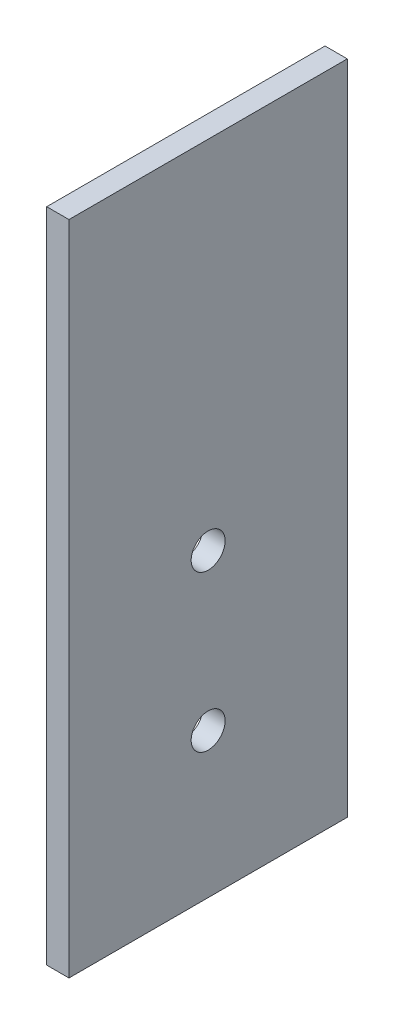
ISO-10303-21;
HEADER;
FILE_DESCRIPTION(('STEP AP214'),'2;1');
FILE_NAME('part.step','',(''),(''),'','','');
FILE_SCHEMA(('AUTOMOTIVE_DESIGN { 1 0 10303 214 1 1 1 1 }'));
ENDSEC;
DATA;
#1=APPLICATION_CONTEXT('core data for automotive mechanical design processes');
#2=APPLICATION_PROTOCOL_DEFINITION('international standard','automotive_design',2000,#1);
#3=PRODUCT_CONTEXT('',#1,'mechanical');
#4=PRODUCT('Part','Part','',(#3));
#5=PRODUCT_RELATED_PRODUCT_CATEGORY('part','',(#4));
#6=PRODUCT_DEFINITION_FORMATION('','',#4);
#7=PRODUCT_DEFINITION_CONTEXT('part definition',#1,'design');
#8=PRODUCT_DEFINITION('design','',#6,#7);
#9=PRODUCT_DEFINITION_SHAPE('','',#8);
#10=(LENGTH_UNIT() NAMED_UNIT(*) SI_UNIT(.MILLI.,.METRE.));
#11=(NAMED_UNIT(*) PLANE_ANGLE_UNIT() SI_UNIT($,.RADIAN.));
#12=(NAMED_UNIT(*) SI_UNIT($,.STERADIAN.) SOLID_ANGLE_UNIT());
#13=UNCERTAINTY_MEASURE_WITH_UNIT(LENGTH_MEASURE(1.E-05),#10,'distance_accuracy_value','');
#14=(GEOMETRIC_REPRESENTATION_CONTEXT(3) GLOBAL_UNCERTAINTY_ASSIGNED_CONTEXT((#13)) GLOBAL_UNIT_ASSIGNED_CONTEXT((#10,
#11,#12)) REPRESENTATION_CONTEXT('',''));
#15=CARTESIAN_POINT('',(0.,0.,0.));
#16=DIRECTION('',(0.,0.,1.));
#17=DIRECTION('',(1.,0.,0.));
#18=AXIS2_PLACEMENT_3D('',#15,#16,#17);
#19=CARTESIAN_POINT('',(2.,42.1043956043956,25.));
#20=DIRECTION('',(0.,0.,-1.));
#21=DIRECTION('',(0.,1.,0.));
#22=AXIS2_PLACEMENT_3D('',#19,#20,#21);
#23=PLANE('',#22);
#24=DIRECTION('',(0.,-1.,0.));
#25=VECTOR('',#24,1.);
#26=CARTESIAN_POINT('',(0.,42.1043956043956,25.));
#27=LINE('',#26,#25);
#28=CARTESIAN_POINT('',(0.,42.1043956043956,25.));
#29=VERTEX_POINT('',#28);
#30=CARTESIAN_POINT('',(0.,-16.8956043956044,25.));
#31=VERTEX_POINT('',#30);
#32=EDGE_CURVE('E109',#29,#31,#27,.T.);
#33=ORIENTED_EDGE('',*,*,#32,.T.);
#34=DIRECTION('',(-1.,0.,0.));
#35=VECTOR('',#34,1.);
#36=CARTESIAN_POINT('',(2.,-16.8956043956044,25.));
#37=LINE('',#36,#35);
#38=CARTESIAN_POINT('',(2.,-16.8956043956044,25.));
#39=VERTEX_POINT('',#38);
#40=EDGE_CURVE('E11',#39,#31,#37,.T.);
#41=ORIENTED_EDGE('',*,*,#40,.F.);
#42=DIRECTION('',(0.,-1.,0.));
#43=VECTOR('',#42,1.);
#44=CARTESIAN_POINT('',(2.,42.1043956043956,25.));
#45=LINE('',#44,#43);
#46=CARTESIAN_POINT('',(2.,42.1043956043956,25.));
#47=VERTEX_POINT('',#46);
#48=EDGE_CURVE('E93',#47,#39,#45,.T.);
#49=ORIENTED_EDGE('',*,*,#48,.F.);
#50=DIRECTION('',(-1.,0.,0.));
#51=VECTOR('',#50,1.);
#52=CARTESIAN_POINT('',(2.,42.1043956043956,25.));
#53=LINE('',#52,#51);
#54=EDGE_CURVE('E105',#47,#29,#53,.T.);
#55=ORIENTED_EDGE('',*,*,#54,.T.);
#56=EDGE_LOOP('',(#33,#41,#49,#55));
#57=FACE_BOUND('',#56,.T.);
#58=ADVANCED_FACE('F41',(#57),#23,.F.);
#59=CARTESIAN_POINT('',(2.,-16.8956043956044,25.));
#60=DIRECTION('',(0.,1.,0.));
#61=DIRECTION('',(0.,0.,1.));
#62=AXIS2_PLACEMENT_3D('',#59,#60,#61);
#63=PLANE('',#62);
#64=DIRECTION('',(0.,0.,-1.));
#65=VECTOR('',#64,1.);
#66=CARTESIAN_POINT('',(0.,-16.8956043956044,25.));
#67=LINE('',#66,#65);
#68=CARTESIAN_POINT('',(0.,-16.8956043956044,0.));
#69=VERTEX_POINT('',#68);
#70=EDGE_CURVE('E98',#31,#69,#67,.T.);
#71=ORIENTED_EDGE('',*,*,#70,.T.);
#72=DIRECTION('',(-1.,0.,0.));
#73=VECTOR('',#72,1.);
#74=CARTESIAN_POINT('',(2.,-16.8956043956044,0.));
#75=LINE('',#74,#73);
#76=CARTESIAN_POINT('',(2.,-16.8956043956044,0.));
#77=VERTEX_POINT('',#76);
#78=EDGE_CURVE('E50',#77,#69,#75,.T.);
#79=ORIENTED_EDGE('',*,*,#78,.F.);
#80=DIRECTION('',(0.,0.,-1.));
#81=VECTOR('',#80,1.);
#82=CARTESIAN_POINT('',(2.,-16.8956043956044,25.));
#83=LINE('',#82,#81);
#84=EDGE_CURVE('E88',#39,#77,#83,.T.);
#85=ORIENTED_EDGE('',*,*,#84,.F.);
#86=ORIENTED_EDGE('',*,*,#40,.T.);
#87=EDGE_LOOP('',(#71,#79,#85,#86));
#88=FACE_BOUND('',#87,.T.);
#89=ADVANCED_FACE('F97',(#88),#63,.F.);
#90=CARTESIAN_POINT('',(2.,42.1043956043956,0.));
#91=DIRECTION('',(0.,0.,1.));
#92=DIRECTION('',(0.,-1.,0.));
#93=AXIS2_PLACEMENT_3D('',#90,#91,#92);
#94=PLANE('',#93);
#95=DIRECTION('',(0.,1.,0.));
#96=VECTOR('',#95,1.);
#97=CARTESIAN_POINT('',(0.,42.1043956043956,0.));
#98=LINE('',#97,#96);
#99=CARTESIAN_POINT('',(0.,42.1043956043956,0.));
#100=VERTEX_POINT('',#99);
#101=EDGE_CURVE('E75',#69,#100,#98,.T.);
#102=ORIENTED_EDGE('',*,*,#101,.T.);
#103=DIRECTION('',(-1.,0.,0.));
#104=VECTOR('',#103,1.);
#105=CARTESIAN_POINT('',(2.,42.1043956043956,0.));
#106=LINE('',#105,#104);
#107=CARTESIAN_POINT('',(2.,42.1043956043956,0.));
#108=VERTEX_POINT('',#107);
#109=EDGE_CURVE('E100',#108,#100,#106,.T.);
#110=ORIENTED_EDGE('',*,*,#109,.F.);
#111=DIRECTION('',(0.,1.,0.));
#112=VECTOR('',#111,1.);
#113=CARTESIAN_POINT('',(2.,42.1043956043956,0.));
#114=LINE('',#113,#112);
#115=EDGE_CURVE('E91',#77,#108,#114,.T.);
#116=ORIENTED_EDGE('',*,*,#115,.F.);
#117=ORIENTED_EDGE('',*,*,#78,.T.);
#118=EDGE_LOOP('',(#102,#110,#116,#117));
#119=FACE_BOUND('',#118,.T.);
#120=ADVANCED_FACE('F101',(#119),#94,.F.);
#121=CARTESIAN_POINT('',(2.,42.1043956043956,25.));
#122=DIRECTION('',(0.,-1.,0.));
#123=DIRECTION('',(0.,0.,-1.));
#124=AXIS2_PLACEMENT_3D('',#121,#122,#123);
#125=PLANE('',#124);
#126=DIRECTION('',(0.,0.,1.));
#127=VECTOR('',#126,1.);
#128=CARTESIAN_POINT('',(0.,42.1043956043956,25.));
#129=LINE('',#128,#127);
#130=EDGE_CURVE('E81',#100,#29,#129,.T.);
#131=ORIENTED_EDGE('',*,*,#130,.T.);
#132=ORIENTED_EDGE('',*,*,#54,.F.);
#133=DIRECTION('',(0.,0.,1.));
#134=VECTOR('',#133,1.);
#135=CARTESIAN_POINT('',(2.,42.1043956043956,25.));
#136=LINE('',#135,#134);
#137=EDGE_CURVE('E58',#108,#47,#136,.T.);
#138=ORIENTED_EDGE('',*,*,#137,.F.);
#139=ORIENTED_EDGE('',*,*,#109,.T.);
#140=EDGE_LOOP('',(#131,#132,#138,#139));
#141=FACE_BOUND('',#140,.T.);
#142=ADVANCED_FACE('F123',(#141),#125,.F.);
#143=CARTESIAN_POINT('',(2.,0.,0.));
#144=DIRECTION('',(1.,0.,0.));
#145=DIRECTION('',(0.,0.,-1.));
#146=AXIS2_PLACEMENT_3D('',#143,#144,#145);
#147=PLANE('',#146);
#148=CARTESIAN_POINT('',(2.,-3.8956043956044,12.5));
#149=DIRECTION('',(-1.,0.,0.));
#150=DIRECTION('',(0.,0.,1.));
#151=AXIS2_PLACEMENT_3D('',#148,#149,#150);
#152=CIRCLE('',#151,1.525);
#153=CARTESIAN_POINT('',(2.,-3.8956043956044,14.025));
#154=VERTEX_POINT('',#153);
#155=EDGE_CURVE('E113',#154,#154,#152,.T.);
#156=ORIENTED_EDGE('',*,*,#155,.T.);
#157=EDGE_LOOP('',(#156));
#158=FACE_BOUND('',#157,.T.);
#159=CARTESIAN_POINT('',(2.,10.1043956043956,12.5));
#160=DIRECTION('',(-1.,0.,0.));
#161=DIRECTION('',(0.,0.,1.));
#162=AXIS2_PLACEMENT_3D('',#159,#160,#161);
#163=CIRCLE('',#162,1.525);
#164=CARTESIAN_POINT('',(2.,10.1043956043956,14.025));
#165=VERTEX_POINT('',#164);
#166=EDGE_CURVE('E134',#165,#165,#163,.T.);
#167=ORIENTED_EDGE('',*,*,#166,.T.);
#168=EDGE_LOOP('',(#167));
#169=FACE_BOUND('',#168,.T.);
#170=ORIENTED_EDGE('',*,*,#48,.T.);
#171=ORIENTED_EDGE('',*,*,#84,.T.);
#172=ORIENTED_EDGE('',*,*,#115,.T.);
#173=ORIENTED_EDGE('',*,*,#137,.T.);
#174=EDGE_LOOP('',(#170,#171,#172,#173));
#175=FACE_BOUND('',#174,.T.);
#176=ADVANCED_FACE('F89',(#158,#169,#175),#147,.T.);
#177=CARTESIAN_POINT('',(0.,0.,0.));
#178=DIRECTION('',(1.,0.,0.));
#179=DIRECTION('',(0.,0.,-1.));
#180=AXIS2_PLACEMENT_3D('',#177,#178,#179);
#181=PLANE('',#180);
#182=CARTESIAN_POINT('',(0.,-3.8956043956044,12.5));
#183=DIRECTION('',(-1.,0.,0.));
#184=DIRECTION('',(0.,0.,1.));
#185=AXIS2_PLACEMENT_3D('',#182,#183,#184);
#186=CIRCLE('',#185,1.525);
#187=CARTESIAN_POINT('',(0.,-3.8956043956044,14.025));
#188=VERTEX_POINT('',#187);
#189=EDGE_CURVE('E138',#188,#188,#186,.T.);
#190=ORIENTED_EDGE('',*,*,#189,.F.);
#191=EDGE_LOOP('',(#190));
#192=FACE_BOUND('',#191,.T.);
#193=CARTESIAN_POINT('',(0.,10.1043956043956,12.5));
#194=DIRECTION('',(-1.,0.,0.));
#195=DIRECTION('',(0.,0.,1.));
#196=AXIS2_PLACEMENT_3D('',#193,#194,#195);
#197=CIRCLE('',#196,1.525);
#198=CARTESIAN_POINT('',(0.,10.1043956043956,14.025));
#199=VERTEX_POINT('',#198);
#200=EDGE_CURVE('E130',#199,#199,#197,.T.);
#201=ORIENTED_EDGE('',*,*,#200,.F.);
#202=EDGE_LOOP('',(#201));
#203=FACE_BOUND('',#202,.T.);
#204=ORIENTED_EDGE('',*,*,#32,.F.);
#205=ORIENTED_EDGE('',*,*,#130,.F.);
#206=ORIENTED_EDGE('',*,*,#101,.F.);
#207=ORIENTED_EDGE('',*,*,#70,.F.);
#208=EDGE_LOOP('',(#204,#205,#206,#207));
#209=FACE_BOUND('',#208,.T.);
#210=ADVANCED_FACE('F126',(#192,#203,#209),#181,.F.);
#211=CARTESIAN_POINT('',(2.,10.1043956043956,12.5));
#212=DIRECTION('',(-1.,0.,0.));
#213=DIRECTION('',(0.,0.,1.));
#214=AXIS2_PLACEMENT_3D('',#211,#212,#213);
#215=CYLINDRICAL_SURFACE('',#214,1.525);
#216=ORIENTED_EDGE('',*,*,#166,.F.);
#217=EDGE_LOOP('',(#216));
#218=FACE_BOUND('',#217,.T.);
#219=ORIENTED_EDGE('',*,*,#200,.T.);
#220=EDGE_LOOP('',(#219));
#221=FACE_BOUND('',#220,.T.);
#222=ADVANCED_FACE('F151',(#218,#221),#215,.F.);
#223=CARTESIAN_POINT('',(2.,-3.8956043956044,12.5));
#224=DIRECTION('',(-1.,0.,0.));
#225=DIRECTION('',(0.,0.,1.));
#226=AXIS2_PLACEMENT_3D('',#223,#224,#225);
#227=CYLINDRICAL_SURFACE('',#226,1.525);
#228=ORIENTED_EDGE('',*,*,#155,.F.);
#229=EDGE_LOOP('',(#228));
#230=FACE_BOUND('',#229,.T.);
#231=ORIENTED_EDGE('',*,*,#189,.T.);
#232=EDGE_LOOP('',(#231));
#233=FACE_BOUND('',#232,.T.);
#234=ADVANCED_FACE('F148',(#230,#233),#227,.F.);
#235=CLOSED_SHELL('',(#58,#89,#120,#142,#176,#210,#222,#234));
#236=MANIFOLD_SOLID_BREP('B2',#235);
#237=ADVANCED_BREP_SHAPE_REPRESENTATION('',(#18,#236),#14);
#238=SHAPE_DEFINITION_REPRESENTATION(#9,#237);
ENDSEC;
END-ISO-10303-21;
